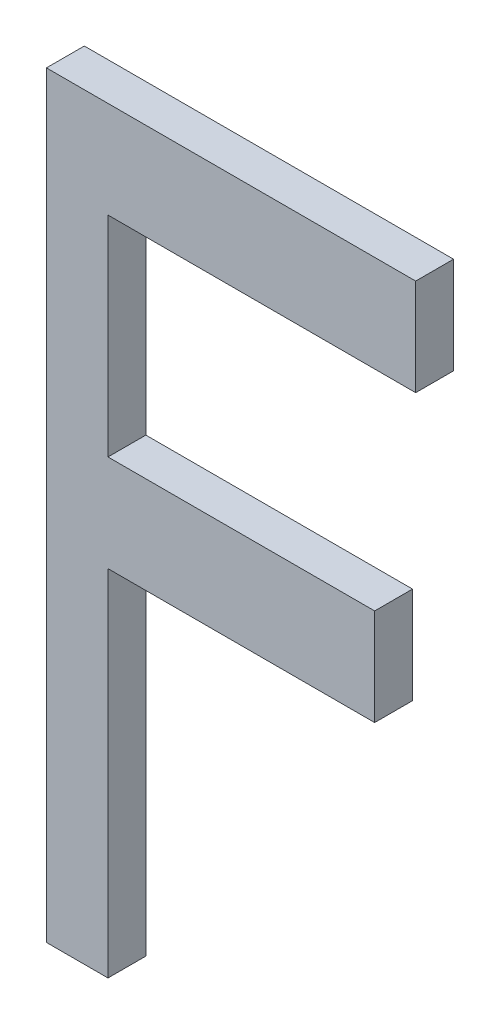
ISO-10303-21;
HEADER;
FILE_DESCRIPTION(('STEP AP214'),'2;1');
FILE_NAME('part.step','',(''),(''),'','','');
FILE_SCHEMA(('AUTOMOTIVE_DESIGN { 1 0 10303 214 1 1 1 1 }'));
ENDSEC;
DATA;
#1=APPLICATION_CONTEXT('core data for automotive mechanical design processes');
#2=APPLICATION_PROTOCOL_DEFINITION('international standard','automotive_design',2000,#1);
#3=PRODUCT_CONTEXT('',#1,'mechanical');
#4=PRODUCT('Part','Part','',(#3));
#5=PRODUCT_RELATED_PRODUCT_CATEGORY('part','',(#4));
#6=PRODUCT_DEFINITION_FORMATION('','',#4);
#7=PRODUCT_DEFINITION_CONTEXT('part definition',#1,'design');
#8=PRODUCT_DEFINITION('design','',#6,#7);
#9=PRODUCT_DEFINITION_SHAPE('','',#8);
#10=(LENGTH_UNIT() NAMED_UNIT(*) SI_UNIT(.MILLI.,.METRE.));
#11=(NAMED_UNIT(*) PLANE_ANGLE_UNIT() SI_UNIT($,.RADIAN.));
#12=(NAMED_UNIT(*) SI_UNIT($,.STERADIAN.) SOLID_ANGLE_UNIT());
#13=UNCERTAINTY_MEASURE_WITH_UNIT(LENGTH_MEASURE(1.E-05),#10,'distance_accuracy_value','');
#14=(GEOMETRIC_REPRESENTATION_CONTEXT(3) GLOBAL_UNCERTAINTY_ASSIGNED_CONTEXT((#13)) GLOBAL_UNIT_ASSIGNED_CONTEXT((#10,
#11,#12)) REPRESENTATION_CONTEXT('',''));
#15=CARTESIAN_POINT('',(0.,0.,0.));
#16=DIRECTION('',(0.,0.,1.));
#17=DIRECTION('',(1.,0.,0.));
#18=AXIS2_PLACEMENT_3D('',#15,#16,#17);
#19=CARTESIAN_POINT('',(167.414831113507,28.2906710184782,5.9));
#20=DIRECTION('',(0.,0.,1.));
#21=DIRECTION('',(1.,0.,0.));
#22=AXIS2_PLACEMENT_3D('',#19,#20,#21);
#23=PLANE('',#22);
#24=DIRECTION('',(1.,0.,0.));
#25=VECTOR('',#24,1.);
#26=CARTESIAN_POINT('',(167.414831113507,30.2906710184782,5.9));
#27=LINE('',#26,#25);
#28=CARTESIAN_POINT('',(168.389831113507,30.2906710184782,5.9));
#29=VERTEX_POINT('',#28);
#30=CARTESIAN_POINT('',(167.414831113507,30.2906710184782,5.9));
#31=VERTEX_POINT('',#30);
#32=EDGE_CURVE('E126',#29,#31,#27,.F.);
#33=ORIENTED_EDGE('',*,*,#32,.F.);
#34=DIRECTION('',(0.,1.,0.));
#35=VECTOR('',#34,1.);
#36=CARTESIAN_POINT('',(168.389831113507,28.2906710184782,5.9));
#37=LINE('',#36,#35);
#38=CARTESIAN_POINT('',(168.389831113507,30.0353518999782,5.9));
#39=VERTEX_POINT('',#38);
#40=EDGE_CURVE('E124',#39,#29,#37,.T.);
#41=ORIENTED_EDGE('',*,*,#40,.F.);
#42=DIRECTION('',(1.,0.,0.));
#43=VECTOR('',#42,1.);
#44=CARTESIAN_POINT('',(167.414831113507,30.0353518999782,5.9));
#45=LINE('',#44,#43);
#46=CARTESIAN_POINT('',(167.577331113507,30.0353518999782,5.9));
#47=VERTEX_POINT('',#46);
#48=EDGE_CURVE('E122',#47,#39,#45,.T.);
#49=ORIENTED_EDGE('',*,*,#48,.F.);
#50=DIRECTION('',(0.,1.,0.));
#51=VECTOR('',#50,1.);
#52=CARTESIAN_POINT('',(167.577331113507,28.2906710184782,5.9));
#53=LINE('',#52,#51);
#54=CARTESIAN_POINT('',(167.577331113507,29.4821603573582,5.9));
#55=VERTEX_POINT('',#54);
#56=EDGE_CURVE('E120',#55,#47,#53,.T.);
#57=ORIENTED_EDGE('',*,*,#56,.F.);
#58=DIRECTION('',(1.,0.,0.));
#59=VECTOR('',#58,1.);
#60=CARTESIAN_POINT('',(167.414831113507,29.4821603573582,5.9));
#61=LINE('',#60,#59);
#62=CARTESIAN_POINT('',(168.281497806007,29.4821603573582,5.9));
#63=VERTEX_POINT('',#62);
#64=EDGE_CURVE('E118',#63,#55,#61,.F.);
#65=ORIENTED_EDGE('',*,*,#64,.F.);
#66=DIRECTION('',(0.,1.,0.));
#67=VECTOR('',#66,1.);
#68=CARTESIAN_POINT('',(168.281497806007,28.2906710184782,5.9));
#69=LINE('',#68,#67);
#70=CARTESIAN_POINT('',(168.281497806007,29.2268412388582,5.9));
#71=VERTEX_POINT('',#70);
#72=EDGE_CURVE('E114',#71,#63,#69,.T.);
#73=ORIENTED_EDGE('',*,*,#72,.F.);
#74=DIRECTION('',(1.,0.,0.));
#75=VECTOR('',#74,1.);
#76=CARTESIAN_POINT('',(167.414831113507,29.2268412388582,5.9));
#77=LINE('',#76,#75);
#78=CARTESIAN_POINT('',(167.577331113507,29.2268412388582,5.9));
#79=VERTEX_POINT('',#78);
#80=EDGE_CURVE('E113',#79,#71,#77,.T.);
#81=ORIENTED_EDGE('',*,*,#80,.F.);
#82=DIRECTION('',(0.,1.,0.));
#83=VECTOR('',#82,1.);
#84=CARTESIAN_POINT('',(167.577331113508,28.2906710184782,5.9));
#85=LINE('',#84,#83);
#86=CARTESIAN_POINT('',(167.577331113507,28.2906710184782,5.9));
#87=VERTEX_POINT('',#86);
#88=EDGE_CURVE('E91',#87,#79,#85,.T.);
#89=ORIENTED_EDGE('',*,*,#88,.F.);
#90=DIRECTION('',(1.,0.,0.));
#91=VECTOR('',#90,1.);
#92=CARTESIAN_POINT('',(167.414831113507,28.2906710184782,5.9));
#93=LINE('',#92,#91);
#94=CARTESIAN_POINT('',(167.414831113507,28.2906710184782,5.9));
#95=VERTEX_POINT('',#94);
#96=EDGE_CURVE('E20',#95,#87,#93,.T.);
#97=ORIENTED_EDGE('',*,*,#96,.F.);
#98=DIRECTION('',(0.,1.,0.));
#99=VECTOR('',#98,1.);
#100=CARTESIAN_POINT('',(167.414831113507,30.2906710184782,5.9));
#101=LINE('',#100,#99);
#102=EDGE_CURVE('E128',#95,#31,#101,.T.);
#103=ORIENTED_EDGE('',*,*,#102,.T.);
#104=EDGE_LOOP('',(#33,#41,#49,#57,#65,#73,#81,#89,#97,#103));
#105=FACE_BOUND('',#104,.T.);
#106=ADVANCED_FACE('F17',(#105),#23,.F.);
#107=CARTESIAN_POINT('',(167.414831113507,30.2906710184782,6.));
#108=DIRECTION('',(1.,0.,0.));
#109=DIRECTION('',(0.,0.,-1.));
#110=AXIS2_PLACEMENT_3D('',#107,#108,#109);
#111=PLANE('',#110);
#112=DIRECTION('',(0.,0.,1.));
#113=VECTOR('',#112,1.);
#114=CARTESIAN_POINT('',(167.414831113507,28.2906710184782,6.));
#115=LINE('',#114,#113);
#116=CARTESIAN_POINT('',(167.414831113507,28.2906710184782,6.));
#117=VERTEX_POINT('',#116);
#118=EDGE_CURVE('E100',#95,#117,#115,.T.);
#119=ORIENTED_EDGE('',*,*,#118,.T.);
#120=DIRECTION('',(0.,1.,0.));
#121=VECTOR('',#120,1.);
#122=CARTESIAN_POINT('',(167.414831113507,28.2906710184782,6.));
#123=LINE('',#122,#121);
#124=CARTESIAN_POINT('',(167.414831113507,30.2906710184782,6.));
#125=VERTEX_POINT('',#124);
#126=EDGE_CURVE('E146',#125,#117,#123,.F.);
#127=ORIENTED_EDGE('',*,*,#126,.F.);
#128=DIRECTION('',(0.,0.,-1.));
#129=VECTOR('',#128,1.);
#130=CARTESIAN_POINT('',(167.414831113507,30.2906710184782,6.));
#131=LINE('',#130,#129);
#132=EDGE_CURVE('E143',#125,#31,#131,.T.);
#133=ORIENTED_EDGE('',*,*,#132,.T.);
#134=ORIENTED_EDGE('',*,*,#102,.F.);
#135=EDGE_LOOP('',(#119,#127,#133,#134));
#136=FACE_BOUND('',#135,.T.);
#137=ADVANCED_FACE('F181',(#136),#111,.F.);
#138=CARTESIAN_POINT('',(167.414831113507,28.2906710184782,6.));
#139=DIRECTION('',(0.,1.,0.));
#140=DIRECTION('',(0.,0.,1.));
#141=AXIS2_PLACEMENT_3D('',#138,#139,#140);
#142=PLANE('',#141);
#143=DIRECTION('',(0.,0.,1.));
#144=VECTOR('',#143,1.);
#145=CARTESIAN_POINT('',(167.577331113507,28.2906710184782,6.));
#146=LINE('',#145,#144);
#147=CARTESIAN_POINT('',(167.577331113507,28.2906710184782,6.));
#148=VERTEX_POINT('',#147);
#149=EDGE_CURVE('E98',#87,#148,#146,.T.);
#150=ORIENTED_EDGE('',*,*,#149,.T.);
#151=DIRECTION('',(1.,0.,0.));
#152=VECTOR('',#151,1.);
#153=CARTESIAN_POINT('',(167.414831113507,28.2906710184782,6.));
#154=LINE('',#153,#152);
#155=EDGE_CURVE('E149',#117,#148,#154,.T.);
#156=ORIENTED_EDGE('',*,*,#155,.F.);
#157=ORIENTED_EDGE('',*,*,#118,.F.);
#158=ORIENTED_EDGE('',*,*,#96,.T.);
#159=EDGE_LOOP('',(#150,#156,#157,#158));
#160=FACE_BOUND('',#159,.T.);
#161=ADVANCED_FACE('F96',(#160),#142,.F.);
#162=CARTESIAN_POINT('',(167.577331113507,28.2906710184782,6.));
#163=DIRECTION('',(-1.,0.,0.));
#164=DIRECTION('',(0.,0.,1.));
#165=AXIS2_PLACEMENT_3D('',#162,#163,#164);
#166=PLANE('',#165);
#167=DIRECTION('',(0.,0.,1.));
#168=VECTOR('',#167,1.);
#169=CARTESIAN_POINT('',(167.577331113507,29.2268412388582,6.));
#170=LINE('',#169,#168);
#171=CARTESIAN_POINT('',(167.577331113507,29.2268412388582,6.));
#172=VERTEX_POINT('',#171);
#173=EDGE_CURVE('E108',#79,#172,#170,.T.);
#174=ORIENTED_EDGE('',*,*,#173,.T.);
#175=DIRECTION('',(0.,1.,0.));
#176=VECTOR('',#175,1.);
#177=CARTESIAN_POINT('',(167.577331113508,28.2906710184782,6.));
#178=LINE('',#177,#176);
#179=EDGE_CURVE('E106',#148,#172,#178,.T.);
#180=ORIENTED_EDGE('',*,*,#179,.F.);
#181=ORIENTED_EDGE('',*,*,#149,.F.);
#182=ORIENTED_EDGE('',*,*,#88,.T.);
#183=EDGE_LOOP('',(#174,#180,#181,#182));
#184=FACE_BOUND('',#183,.T.);
#185=ADVANCED_FACE('F104',(#184),#166,.F.);
#186=CARTESIAN_POINT('',(167.577331113507,29.2268412388582,6.));
#187=DIRECTION('',(0.,1.,0.));
#188=DIRECTION('',(0.,0.,1.));
#189=AXIS2_PLACEMENT_3D('',#186,#187,#188);
#190=PLANE('',#189);
#191=DIRECTION('',(0.,0.,1.));
#192=VECTOR('',#191,1.);
#193=CARTESIAN_POINT('',(168.281497806007,29.2268412388582,6.));
#194=LINE('',#193,#192);
#195=CARTESIAN_POINT('',(168.281497806007,29.2268412388582,6.));
#196=VERTEX_POINT('',#195);
#197=EDGE_CURVE('E132',#71,#196,#194,.T.);
#198=ORIENTED_EDGE('',*,*,#197,.T.);
#199=DIRECTION('',(1.,0.,0.));
#200=VECTOR('',#199,1.);
#201=CARTESIAN_POINT('',(167.414831113507,29.2268412388582,6.));
#202=LINE('',#201,#200);
#203=EDGE_CURVE('E152',#172,#196,#202,.T.);
#204=ORIENTED_EDGE('',*,*,#203,.F.);
#205=ORIENTED_EDGE('',*,*,#173,.F.);
#206=ORIENTED_EDGE('',*,*,#80,.T.);
#207=EDGE_LOOP('',(#198,#204,#205,#206));
#208=FACE_BOUND('',#207,.T.);
#209=ADVANCED_FACE('F185',(#208),#190,.F.);
#210=CARTESIAN_POINT('',(168.281497806007,29.2268412388582,6.));
#211=DIRECTION('',(-1.,0.,0.));
#212=DIRECTION('',(0.,0.,1.));
#213=AXIS2_PLACEMENT_3D('',#210,#211,#212);
#214=PLANE('',#213);
#215=DIRECTION('',(0.,0.,-1.));
#216=VECTOR('',#215,1.);
#217=CARTESIAN_POINT('',(168.281497806007,29.4821603573582,6.));
#218=LINE('',#217,#216);
#219=CARTESIAN_POINT('',(168.281497806007,29.4821603573582,6.));
#220=VERTEX_POINT('',#219);
#221=EDGE_CURVE('E134',#63,#220,#218,.F.);
#222=ORIENTED_EDGE('',*,*,#221,.T.);
#223=DIRECTION('',(0.,1.,0.));
#224=VECTOR('',#223,1.);
#225=CARTESIAN_POINT('',(168.281497806007,28.2906710184782,6.));
#226=LINE('',#225,#224);
#227=EDGE_CURVE('E155',#196,#220,#226,.T.);
#228=ORIENTED_EDGE('',*,*,#227,.F.);
#229=ORIENTED_EDGE('',*,*,#197,.F.);
#230=ORIENTED_EDGE('',*,*,#72,.T.);
#231=EDGE_LOOP('',(#222,#228,#229,#230));
#232=FACE_BOUND('',#231,.T.);
#233=ADVANCED_FACE('F188',(#232),#214,.F.);
#234=CARTESIAN_POINT('',(168.281497806007,29.4821603573582,6.));
#235=DIRECTION('',(0.,-1.,0.));
#236=DIRECTION('',(0.,0.,-1.));
#237=AXIS2_PLACEMENT_3D('',#234,#235,#236);
#238=PLANE('',#237);
#239=DIRECTION('',(0.,0.,1.));
#240=VECTOR('',#239,1.);
#241=CARTESIAN_POINT('',(167.577331113507,29.4821603573582,6.));
#242=LINE('',#241,#240);
#243=CARTESIAN_POINT('',(167.577331113507,29.4821603573582,6.));
#244=VERTEX_POINT('',#243);
#245=EDGE_CURVE('E136',#55,#244,#242,.T.);
#246=ORIENTED_EDGE('',*,*,#245,.T.);
#247=DIRECTION('',(1.,0.,0.));
#248=VECTOR('',#247,1.);
#249=CARTESIAN_POINT('',(167.414831113507,29.4821603573582,6.));
#250=LINE('',#249,#248);
#251=EDGE_CURVE('E158',#220,#244,#250,.F.);
#252=ORIENTED_EDGE('',*,*,#251,.F.);
#253=ORIENTED_EDGE('',*,*,#221,.F.);
#254=ORIENTED_EDGE('',*,*,#64,.T.);
#255=EDGE_LOOP('',(#246,#252,#253,#254));
#256=FACE_BOUND('',#255,.T.);
#257=ADVANCED_FACE('F193',(#256),#238,.F.);
#258=CARTESIAN_POINT('',(167.577331113507,29.4821603573582,6.));
#259=DIRECTION('',(-1.,0.,0.));
#260=DIRECTION('',(0.,0.,1.));
#261=AXIS2_PLACEMENT_3D('',#258,#259,#260);
#262=PLANE('',#261);
#263=DIRECTION('',(0.,0.,1.));
#264=VECTOR('',#263,1.);
#265=CARTESIAN_POINT('',(167.577331113507,30.0353518999782,6.));
#266=LINE('',#265,#264);
#267=CARTESIAN_POINT('',(167.577331113507,30.0353518999782,6.));
#268=VERTEX_POINT('',#267);
#269=EDGE_CURVE('E138',#47,#268,#266,.T.);
#270=ORIENTED_EDGE('',*,*,#269,.T.);
#271=DIRECTION('',(0.,1.,0.));
#272=VECTOR('',#271,1.);
#273=CARTESIAN_POINT('',(167.577331113507,28.2906710184782,6.));
#274=LINE('',#273,#272);
#275=EDGE_CURVE('E161',#244,#268,#274,.T.);
#276=ORIENTED_EDGE('',*,*,#275,.F.);
#277=ORIENTED_EDGE('',*,*,#245,.F.);
#278=ORIENTED_EDGE('',*,*,#56,.T.);
#279=EDGE_LOOP('',(#270,#276,#277,#278));
#280=FACE_BOUND('',#279,.T.);
#281=ADVANCED_FACE('F197',(#280),#262,.F.);
#282=CARTESIAN_POINT('',(167.577331113507,30.0353518999782,6.));
#283=DIRECTION('',(0.,1.,0.));
#284=DIRECTION('',(0.,0.,1.));
#285=AXIS2_PLACEMENT_3D('',#282,#283,#284);
#286=PLANE('',#285);
#287=DIRECTION('',(0.,0.,1.));
#288=VECTOR('',#287,1.);
#289=CARTESIAN_POINT('',(168.389831113507,30.0353518999782,6.));
#290=LINE('',#289,#288);
#291=CARTESIAN_POINT('',(168.389831113507,30.0353518999782,6.));
#292=VERTEX_POINT('',#291);
#293=EDGE_CURVE('E140',#39,#292,#290,.T.);
#294=ORIENTED_EDGE('',*,*,#293,.T.);
#295=DIRECTION('',(1.,0.,0.));
#296=VECTOR('',#295,1.);
#297=CARTESIAN_POINT('',(167.414831113507,30.0353518999782,6.));
#298=LINE('',#297,#296);
#299=EDGE_CURVE('E164',#268,#292,#298,.T.);
#300=ORIENTED_EDGE('',*,*,#299,.F.);
#301=ORIENTED_EDGE('',*,*,#269,.F.);
#302=ORIENTED_EDGE('',*,*,#48,.T.);
#303=EDGE_LOOP('',(#294,#300,#301,#302));
#304=FACE_BOUND('',#303,.T.);
#305=ADVANCED_FACE('F199',(#304),#286,.F.);
#306=CARTESIAN_POINT('',(168.389831113507,30.0353518999782,6.));
#307=DIRECTION('',(-1.,0.,0.));
#308=DIRECTION('',(0.,0.,1.));
#309=AXIS2_PLACEMENT_3D('',#306,#307,#308);
#310=PLANE('',#309);
#311=DIRECTION('',(0.,0.,-1.));
#312=VECTOR('',#311,1.);
#313=CARTESIAN_POINT('',(168.389831113507,30.2906710184782,6.));
#314=LINE('',#313,#312);
#315=CARTESIAN_POINT('',(168.389831113507,30.2906710184782,6.));
#316=VERTEX_POINT('',#315);
#317=EDGE_CURVE('E35',#29,#316,#314,.F.);
#318=ORIENTED_EDGE('',*,*,#317,.T.);
#319=DIRECTION('',(0.,1.,0.));
#320=VECTOR('',#319,1.);
#321=CARTESIAN_POINT('',(168.389831113507,28.2906710184782,6.));
#322=LINE('',#321,#320);
#323=EDGE_CURVE('E26',#292,#316,#322,.T.);
#324=ORIENTED_EDGE('',*,*,#323,.F.);
#325=ORIENTED_EDGE('',*,*,#293,.F.);
#326=ORIENTED_EDGE('',*,*,#40,.T.);
#327=EDGE_LOOP('',(#318,#324,#325,#326));
#328=FACE_BOUND('',#327,.T.);
#329=ADVANCED_FACE('F172',(#328),#310,.F.);
#330=CARTESIAN_POINT('',(168.389831113507,30.2906710184782,6.));
#331=DIRECTION('',(0.,-1.,0.));
#332=DIRECTION('',(0.,0.,-1.));
#333=AXIS2_PLACEMENT_3D('',#330,#331,#332);
#334=PLANE('',#333);
#335=ORIENTED_EDGE('',*,*,#132,.F.);
#336=DIRECTION('',(1.,0.,0.));
#337=VECTOR('',#336,1.);
#338=CARTESIAN_POINT('',(167.414831113507,30.2906710184782,6.));
#339=LINE('',#338,#337);
#340=EDGE_CURVE('E11',#316,#125,#339,.F.);
#341=ORIENTED_EDGE('',*,*,#340,.F.);
#342=ORIENTED_EDGE('',*,*,#317,.F.);
#343=ORIENTED_EDGE('',*,*,#32,.T.);
#344=EDGE_LOOP('',(#335,#341,#342,#343));
#345=FACE_BOUND('',#344,.T.);
#346=ADVANCED_FACE('F179',(#345),#334,.F.);
#347=CARTESIAN_POINT('',(167.414831113507,28.2906710184782,6.));
#348=DIRECTION('',(0.,0.,1.));
#349=DIRECTION('',(1.,0.,0.));
#350=AXIS2_PLACEMENT_3D('',#347,#348,#349);
#351=PLANE('',#350);
#352=ORIENTED_EDGE('',*,*,#323,.T.);
#353=ORIENTED_EDGE('',*,*,#340,.T.);
#354=ORIENTED_EDGE('',*,*,#126,.T.);
#355=ORIENTED_EDGE('',*,*,#155,.T.);
#356=ORIENTED_EDGE('',*,*,#179,.T.);
#357=ORIENTED_EDGE('',*,*,#203,.T.);
#358=ORIENTED_EDGE('',*,*,#227,.T.);
#359=ORIENTED_EDGE('',*,*,#251,.T.);
#360=ORIENTED_EDGE('',*,*,#275,.T.);
#361=ORIENTED_EDGE('',*,*,#299,.T.);
#362=EDGE_LOOP('',(#352,#353,#354,#355,#356,#357,#358,#359,#360,#361));
#363=FACE_BOUND('',#362,.T.);
#364=ADVANCED_FACE('F169',(#363),#351,.T.);
#365=CLOSED_SHELL('',(#106,#137,#161,#185,#209,#233,#257,#281,#305,#329,#346,#364));
#366=MANIFOLD_SOLID_BREP('B1',#365);
#367=ADVANCED_BREP_SHAPE_REPRESENTATION('',(#18,#366),#14);
#368=SHAPE_DEFINITION_REPRESENTATION(#9,#367);
ENDSEC;
END-ISO-10303-21;
